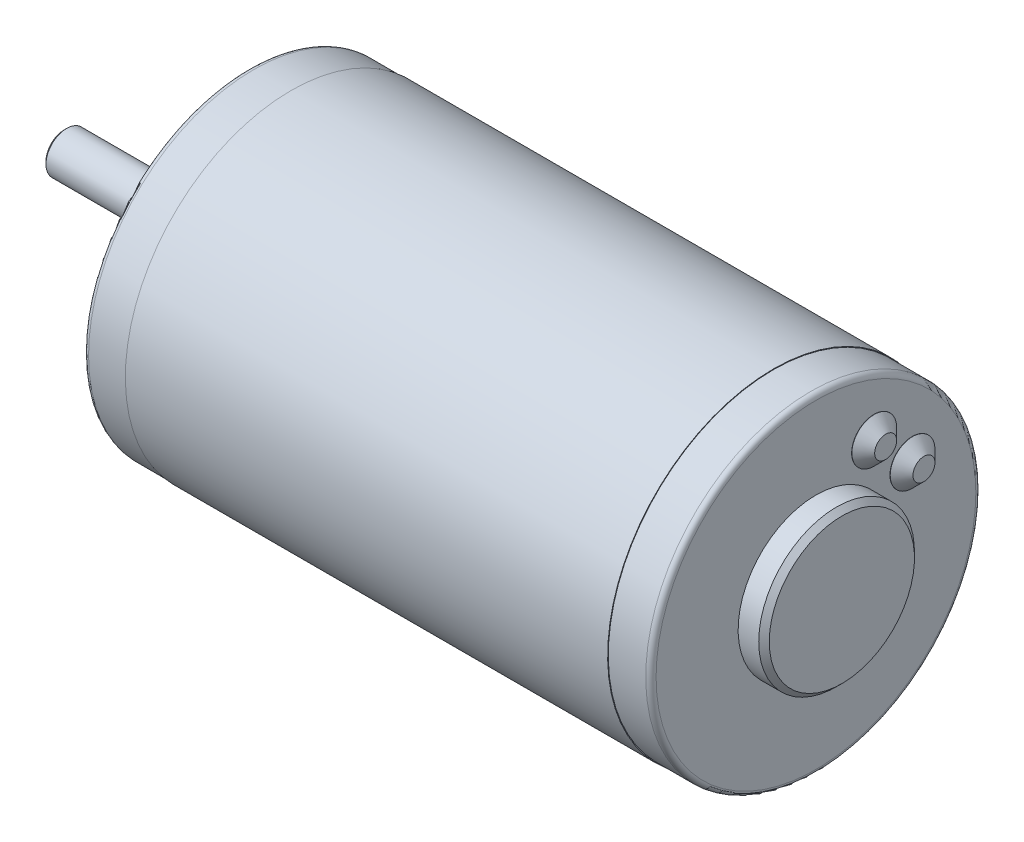
ISO-10303-21;
HEADER;
FILE_DESCRIPTION(('STEP AP214'),'2;1');
FILE_NAME('part.step','',(''),(''),'','','');
FILE_SCHEMA(('AUTOMOTIVE_DESIGN { 1 0 10303 214 1 1 1 1 }'));
ENDSEC;
DATA;
#1=APPLICATION_CONTEXT('core data for automotive mechanical design processes');
#2=APPLICATION_PROTOCOL_DEFINITION('international standard','automotive_design',2000,#1);
#3=PRODUCT_CONTEXT('',#1,'mechanical');
#4=PRODUCT('Part','Part','',(#3));
#5=PRODUCT_RELATED_PRODUCT_CATEGORY('part','',(#4));
#6=PRODUCT_DEFINITION_FORMATION('','',#4);
#7=PRODUCT_DEFINITION_CONTEXT('part definition',#1,'design');
#8=PRODUCT_DEFINITION('design','',#6,#7);
#9=PRODUCT_DEFINITION_SHAPE('','',#8);
#10=(LENGTH_UNIT() NAMED_UNIT(*) SI_UNIT(.MILLI.,.METRE.));
#11=(NAMED_UNIT(*) PLANE_ANGLE_UNIT() SI_UNIT($,.RADIAN.));
#12=(NAMED_UNIT(*) SI_UNIT($,.STERADIAN.) SOLID_ANGLE_UNIT());
#13=UNCERTAINTY_MEASURE_WITH_UNIT(LENGTH_MEASURE(1.E-05),#10,'distance_accuracy_value','');
#14=(GEOMETRIC_REPRESENTATION_CONTEXT(3) GLOBAL_UNCERTAINTY_ASSIGNED_CONTEXT((#13)) GLOBAL_UNIT_ASSIGNED_CONTEXT((#10,
#11,#12)) REPRESENTATION_CONTEXT('',''));
#15=CARTESIAN_POINT('',(0.,0.,0.));
#16=DIRECTION('',(0.,0.,1.));
#17=DIRECTION('',(1.,0.,0.));
#18=AXIS2_PLACEMENT_3D('',#15,#16,#17);
#19=CARTESIAN_POINT('',(-35.6000000000001,1.73472347597681E-13,-2.77555756156289E-13));
#20=DIRECTION('',(-1.,0.,0.));
#21=DIRECTION('',(0.,0.,1.));
#22=AXIS2_PLACEMENT_3D('',#19,#20,#21);
#23=PLANE('',#22);
#24=CARTESIAN_POINT('',(-35.6000000000449,-1.04083408558612E-13,-2.35922392732846E-13));
#25=DIRECTION('',(1.,0.,0.));
#26=DIRECTION('',(0.,0.,-1.));
#27=AXIS2_PLACEMENT_3D('',#24,#25,#26);
#28=CIRCLE('',#27,3.50000000003069);
#29=CARTESIAN_POINT('',(-35.6000000000449,-1.04083408558612E-13,-3.50000000003092));
#30=VERTEX_POINT('',#29);
#31=EDGE_CURVE('E86',#30,#30,#28,.T.);
#32=ORIENTED_EDGE('',*,*,#31,.F.);
#33=EDGE_LOOP('',(#32));
#34=FACE_BOUND('',#33,.T.);
#35=ADVANCED_FACE('F17',(#34),#23,.T.);
#36=CARTESIAN_POINT('',(-27.6,-0.999999999999773,-2.79999999999991));
#37=DIRECTION('',(0.,0.,1.));
#38=DIRECTION('',(0.,-1.,0.));
#39=AXIS2_PLACEMENT_3D('',#36,#37,#38);
#40=PLANE('',#39);
#41=CARTESIAN_POINT('',(-7.09999999999983,0.,-2.80000000000004));
#42=DIRECTION('',(0.,0.,-1.));
#43=DIRECTION('',(0.,1.,0.));
#44=AXIS2_PLACEMENT_3D('',#41,#42,#43);
#45=CIRCLE('',#44,1.);
#46=CARTESIAN_POINT('',(-7.09999999999997,1.00000000000033,-2.8));
#47=VERTEX_POINT('',#46);
#48=CARTESIAN_POINT('',(-7.10000000000005,-0.999999999999912,-2.80000000000004));
#49=VERTEX_POINT('',#48);
#50=EDGE_CURVE('E354',#47,#49,#45,.T.);
#51=ORIENTED_EDGE('',*,*,#50,.T.);
#52=DIRECTION('',(1.,0.,0.));
#53=VECTOR('',#52,1.);
#54=CARTESIAN_POINT('',(-27.6,-0.999999999999773,-2.80000000000001));
#55=LINE('',#54,#53);
#56=CARTESIAN_POINT('',(-26.5999999999999,-0.999999999999773,-2.80000000000001));
#57=VERTEX_POINT('',#56);
#58=EDGE_CURVE('E75',#57,#49,#55,.T.);
#59=ORIENTED_EDGE('',*,*,#58,.F.);
#60=CARTESIAN_POINT('',(-26.6,-1.03988108337105E-13,-2.80000000000001));
#61=DIRECTION('',(0.,0.,1.));
#62=DIRECTION('',(0.,-1.,0.));
#63=AXIS2_PLACEMENT_3D('',#60,#61,#62);
#64=CIRCLE('',#63,1.);
#65=CARTESIAN_POINT('',(-26.5999999999999,1.00000000000012,-2.80000000000001));
#66=VERTEX_POINT('',#65);
#67=EDGE_CURVE('E77',#57,#66,#64,.F.);
#68=ORIENTED_EDGE('',*,*,#67,.T.);
#69=DIRECTION('',(1.,0.,0.));
#70=VECTOR('',#69,1.);
#71=CARTESIAN_POINT('',(-27.5999999999998,1.00000000000033,-2.79999999999996));
#72=LINE('',#71,#70);
#73=EDGE_CURVE('E80',#66,#47,#72,.T.);
#74=ORIENTED_EDGE('',*,*,#73,.T.);
#75=EDGE_LOOP('',(#51,#59,#68,#74));
#76=FACE_BOUND('',#75,.T.);
#77=ADVANCED_FACE('F79',(#76),#40,.F.);
#78=CARTESIAN_POINT('',(-27.5999999999998,1.00000000000033,-2.80000000000007));
#79=DIRECTION('',(0.,1.,0.));
#80=DIRECTION('',(0.,0.,1.));
#81=AXIS2_PLACEMENT_3D('',#78,#79,#80);
#82=PLANE('',#81);
#83=DIRECTION('',(0.,0.,1.));
#84=VECTOR('',#83,1.);
#85=CARTESIAN_POINT('',(-7.10000000000011,1.00000000000033,-2.80000000000007));
#86=LINE('',#85,#84);
#87=CARTESIAN_POINT('',(-7.09999999999997,1.00000000000045,-3.87298334620729));
#88=VERTEX_POINT('',#87);
#89=EDGE_CURVE('E94',#88,#47,#86,.T.);
#90=ORIENTED_EDGE('',*,*,#89,.T.);
#91=ORIENTED_EDGE('',*,*,#73,.F.);
#92=DIRECTION('',(0.,0.,1.));
#93=VECTOR('',#92,1.);
#94=CARTESIAN_POINT('',(-26.5999999999997,0.999999999999896,-3.87298334620738));
#95=LINE('',#94,#93);
#96=CARTESIAN_POINT('',(-26.5999999999999,1.00000000000006,-3.87298334620735));
#97=VERTEX_POINT('',#96);
#98=EDGE_CURVE('E85',#66,#97,#95,.F.);
#99=ORIENTED_EDGE('',*,*,#98,.T.);
#100=DIRECTION('',(1.,0.,0.));
#101=VECTOR('',#100,1.);
#102=CARTESIAN_POINT('',(0.,1.00000000000057,-3.87298334620726));
#103=LINE('',#102,#101);
#104=EDGE_CURVE('E109',#88,#97,#103,.F.);
#105=ORIENTED_EDGE('',*,*,#104,.F.);
#106=EDGE_LOOP('',(#90,#91,#99,#105));
#107=FACE_BOUND('',#106,.T.);
#108=ADVANCED_FACE('F90',(#107),#82,.F.);
#109=CARTESIAN_POINT('',(-35.1000000000568,-1.04083408558612E-13,-2.35922392732846E-13));
#110=DIRECTION('',(1.,0.,0.));
#111=DIRECTION('',(0.,0.,-1.));
#112=AXIS2_PLACEMENT_3D('',#109,#110,#111);
#113=CONICAL_SURFACE('',#112,4.00000000001886,0.785398163397448);
#114=ORIENTED_EDGE('',*,*,#31,.T.);
#115=EDGE_LOOP('',(#114));
#116=FACE_BOUND('',#115,.T.);
#117=CARTESIAN_POINT('',(-35.1000000000003,0.,0.));
#118=DIRECTION('',(1.,0.,0.));
#119=DIRECTION('',(0.,1.,0.));
#120=AXIS2_PLACEMENT_3D('',#117,#118,#119);
#121=CIRCLE('',#120,3.99999999999999);
#122=CARTESIAN_POINT('',(-35.1000000000003,3.99999999999999,0.));
#123=VERTEX_POINT('',#122);
#124=EDGE_CURVE('E107',#123,#123,#121,.T.);
#125=ORIENTED_EDGE('',*,*,#124,.F.);
#126=EDGE_LOOP('',(#125));
#127=FACE_BOUND('',#126,.T.);
#128=ADVANCED_FACE('F364',(#116,#127),#113,.T.);
#129=CARTESIAN_POINT('',(-26.6,-1.04517089427603E-13,-3.87298334620738));
#130=DIRECTION('',(0.,0.,1.));
#131=DIRECTION('',(0.,-1.,0.));
#132=AXIS2_PLACEMENT_3D('',#129,#130,#131);
#133=CYLINDRICAL_SURFACE('',#132,1.);
#134=CARTESIAN_POINT('',(-26.6,0.999999999999896,-3.87298334620744));
#135=CARTESIAN_POINT('',(-26.6276629618862,1.00000033683272,-3.87298148578631));
#136=CARTESIAN_POINT('',(-26.6553122166169,0.998851408973414,-3.87328009898516));
#137=CARTESIAN_POINT('',(-26.7104039432582,0.994271305308465,-3.874459045294));
#138=CARTESIAN_POINT('',(-26.7378464491771,0.99084051352083,-3.87533928052186));
#139=CARTESIAN_POINT('',(-26.8194530833432,0.977175260843312,-3.87881710393728));
#140=CARTESIAN_POINT('',(-26.8730564246123,0.963567703685188,-3.88225202757009));
#141=CARTESIAN_POINT('',(-26.977125593587,0.9277977666641,-3.89095430304384));
#142=CARTESIAN_POINT('',(-27.0275916629556,0.905636046675176,-3.89622151353782));
#143=CARTESIAN_POINT('',(-27.1241130864299,0.853414285078966,-3.90799157486741));
#144=CARTESIAN_POINT('',(-27.1701674100592,0.823352404294419,-3.91449471333244));
#145=CARTESIAN_POINT('',(-27.2575394864379,0.755487979247824,-3.92816193945041));
#146=CARTESIAN_POINT('',(-27.2987466452782,0.71754520146856,-3.93533648748832));
#147=CARTESIAN_POINT('',(-27.374295287631,0.635284227526676,-3.94944965646413));
#148=CARTESIAN_POINT('',(-27.4086343067441,0.590963752716439,-3.95638819197843));
#149=CARTESIAN_POINT('',(-27.4699263913366,0.496434353262319,-3.96936513280701));
#150=CARTESIAN_POINT('',(-27.4967663594361,0.446150035120147,-3.97538918749289));
#151=CARTESIAN_POINT('',(-27.5415435234846,0.34164231638429,-3.98572777190496));
#152=CARTESIAN_POINT('',(-27.5594913901323,0.287423727052179,-3.99004434937703));
#153=CARTESIAN_POINT('',(-27.5817561327114,0.194111735626768,-3.99546891720265));
#154=CARTESIAN_POINT('',(-27.5885857933547,0.15563291802012,-3.99715927898668));
#155=CARTESIAN_POINT('',(-27.5977085408135,0.0781080027780594,-3.99942531582645));
#156=CARTESIAN_POINT('',(-27.6000016937716,0.0390619134218824,-4.00000100713419));
#157=CARTESIAN_POINT('',(-27.599997605085,-0.0552317459833981,-3.99999857595864));
#158=CARTESIAN_POINT('',(-27.5954072017814,-0.110495128478842,-3.99884417849431));
#159=CARTESIAN_POINT('',(-27.5771887284744,-0.219452299234425,-3.99434884496973));
#160=CARTESIAN_POINT('',(-27.5635520456883,-0.273144540728266,-3.99100582520555));
#161=CARTESIAN_POINT('',(-27.5277065776785,-0.377348216031208,-3.98250401525138));
#162=CARTESIAN_POINT('',(-27.50550949133,-0.427863881926167,-3.97734770399772));
#163=CARTESIAN_POINT('',(-27.4532106110737,-0.524450982676889,-3.96576858613918));
#164=CARTESIAN_POINT('',(-27.423109018223,-0.570522530531439,-3.95934581174879));
#165=CARTESIAN_POINT('',(-27.3552003629654,-0.657866871057299,-3.9457829173005));
#166=CARTESIAN_POINT('',(-27.3172610821917,-0.699035148909396,-3.93863172676561));
#167=CARTESIAN_POINT('',(-27.2350335448417,-0.774497762760093,-3.92449111086286));
#168=CARTESIAN_POINT('',(-27.1907442793301,-0.808791004318464,-3.91750171140699));
#169=CARTESIAN_POINT('',(-27.0962571540368,-0.870026617564701,-3.90436326544459));
#170=CARTESIAN_POINT('',(-27.0459800204074,-0.896849892050615,-3.8982285370107));
#171=CARTESIAN_POINT('',(-26.9414633719416,-0.941609493202719,-3.88766043493566));
#172=CARTESIAN_POINT('',(-26.8872268673447,-0.959552492279237,-3.88322578446615));
#173=CARTESIAN_POINT('',(-26.7939162001484,-0.981793057388644,-3.87765011739133));
#174=CARTESIAN_POINT('',(-26.7554596460299,-0.988610024877078,-3.87591131774121));
#175=CARTESIAN_POINT('',(-26.6780089785749,-0.997716332082892,-3.87357302813834));
#176=CARTESIAN_POINT('',(-26.6390152728011,-1.0000089326104,-3.87297271766373));
#177=CARTESIAN_POINT('',(-26.5999999999999,-1.00000000000011,-3.87298334620738));
#178=B_SPLINE_CURVE_WITH_KNOTS('',3,(#134,#135,#136,#137,#138,#139,#140,#141,#142,#143,#144,
#145,#146,#147,#148,#149,#150,#151,#152,#153,#154,#155,#156,#157,#158,#159,#160,#161,#162,#163,
#164,#165,#166,#167,#168,#169,#170,#171,#172,#173,#174,#175,#176,#177),.UNSPECIFIED.,.F.,.F.,(4,
2,2,2,2,2,2,2,2,2,2,2,2,2,2,2,2,2,2,2,2,4),(0.,0.0829364608197416,0.165858967679138,
0.331229962709977,0.496588203456516,0.66198497417125,0.830625162094533,0.999325752711568,
1.17044795789403,1.34136431261154,1.45844938979963,1.57553275986401,1.74108325106581,
1.9067915862413,2.07227425793979,2.23775272086773,2.4062917684524,2.57485762457931,
2.74597444954031,2.91696250578406,3.03398040676348,3.15091393953954),.UNSPECIFIED.);
#179=CARTESIAN_POINT('',(-26.5999999999999,-0.999999999999796,-3.87298334620746));
#180=VERTEX_POINT('',#179);
#181=EDGE_CURVE('E99',#97,#180,#178,.T.);
#182=ORIENTED_EDGE('',*,*,#181,.F.);
#183=ORIENTED_EDGE('',*,*,#98,.F.);
#184=ORIENTED_EDGE('',*,*,#67,.F.);
#185=DIRECTION('',(0.,0.,1.));
#186=VECTOR('',#185,1.);
#187=CARTESIAN_POINT('',(-26.5999999999998,-0.999999999999773,-2.79999999999991));
#188=LINE('',#187,#186);
#189=EDGE_CURVE('E101',#180,#57,#188,.T.);
#190=ORIENTED_EDGE('',*,*,#189,.F.);
#191=EDGE_LOOP('',(#182,#183,#184,#190));
#192=FACE_BOUND('',#191,.T.);
#193=ADVANCED_FACE('F97',(#192),#133,.F.);
#194=CARTESIAN_POINT('',(-27.6,-0.999999999999773,-2.79999999999991));
#195=DIRECTION('',(0.,1.,0.));
#196=DIRECTION('',(0.,0.,1.));
#197=AXIS2_PLACEMENT_3D('',#194,#195,#196);
#198=PLANE('',#197);
#199=DIRECTION('',(1.,0.,0.));
#200=VECTOR('',#199,1.);
#201=CARTESIAN_POINT('',(0.,-0.999999999999817,-3.87298334620746));
#202=LINE('',#201,#200);
#203=CARTESIAN_POINT('',(-7.10000000000022,-0.999999999999993,-3.87298334620743));
#204=VERTEX_POINT('',#203);
#205=EDGE_CURVE('E164',#180,#204,#202,.T.);
#206=ORIENTED_EDGE('',*,*,#205,.F.);
#207=ORIENTED_EDGE('',*,*,#189,.T.);
#208=ORIENTED_EDGE('',*,*,#58,.T.);
#209=DIRECTION('',(0.,0.,-1.));
#210=VECTOR('',#209,1.);
#211=CARTESIAN_POINT('',(-7.10000000000027,-1.00000000000005,-2.8));
#212=LINE('',#211,#210);
#213=EDGE_CURVE('E105',#49,#204,#212,.T.);
#214=ORIENTED_EDGE('',*,*,#213,.T.);
#215=EDGE_LOOP('',(#206,#207,#208,#214));
#216=FACE_BOUND('',#215,.T.);
#217=ADVANCED_FACE('F552',(#216),#198,.T.);
#218=CARTESIAN_POINT('',(-7.09999999999983,0.,-2.8));
#219=DIRECTION('',(0.,0.,-1.));
#220=DIRECTION('',(0.,1.,0.));
#221=AXIS2_PLACEMENT_3D('',#218,#219,#220);
#222=CYLINDRICAL_SURFACE('',#221,1.);
#223=ORIENTED_EDGE('',*,*,#50,.F.);
#224=ORIENTED_EDGE('',*,*,#89,.F.);
#225=CARTESIAN_POINT('',(-7.10000000000016,-1.00000000000005,-3.8729833462074));
#226=CARTESIAN_POINT('',(-7.072337038114,-1.00000033683288,-3.87298148578626));
#227=CARTESIAN_POINT('',(-7.04468778338332,-0.998851408973587,-3.87328009898511));
#228=CARTESIAN_POINT('',(-6.98959605674198,-0.994271305308656,-3.87445904529395));
#229=CARTESIAN_POINT('',(-6.96215355082305,-0.99084051352103,-3.87533928052181));
#230=CARTESIAN_POINT('',(-6.88054691665694,-0.977175260843541,-3.87881710393723));
#231=CARTESIAN_POINT('',(-6.8269435753879,-0.963567703685435,-3.88225202757002));
#232=CARTESIAN_POINT('',(-6.72287440641311,-0.927797766664384,-3.89095430304377));
#233=CARTESIAN_POINT('',(-6.6724083370446,-0.905636046675479,-3.89622151353775));
#234=CARTESIAN_POINT('',(-6.57588691357024,-0.853414285079304,-3.90799157486733));
#235=CARTESIAN_POINT('',(-6.52983258994098,-0.823352404294773,-3.91449471333236));
#236=CARTESIAN_POINT('',(-6.44246051356226,-0.75548797924821,-3.92816193945033));
#237=CARTESIAN_POINT('',(-6.40125335472195,-0.717545201468963,-3.93533648748825));
#238=CARTESIAN_POINT('',(-6.32570471236904,-0.635284227527108,-3.94944965646406));
#239=CARTESIAN_POINT('',(-6.29136569325591,-0.590963752716884,-3.95638819197836));
#240=CARTESIAN_POINT('',(-6.23007360866342,-0.496434353262786,-3.96936513280695));
#241=CARTESIAN_POINT('',(-6.20323364056388,-0.446150035120625,-3.97538918749283));
#242=CARTESIAN_POINT('',(-6.15845647651535,-0.341642316384785,-3.98572777190491));
#243=CARTESIAN_POINT('',(-6.14050860986763,-0.28742372705268,-3.990044349377));
#244=CARTESIAN_POINT('',(-6.11824386728853,-0.194111735627195,-3.99546891720263));
#245=CARTESIAN_POINT('',(-6.11141420664517,-0.155632918020465,-3.99715927898667));
#246=CARTESIAN_POINT('',(-6.10229145918636,-0.0781080027782378,-3.99942531582645));
#247=CARTESIAN_POINT('',(-6.09999830622821,-0.0390619134219762,-4.00000100713419));
#248=CARTESIAN_POINT('',(-6.10000239491486,0.0552317459833889,-3.99999857595864));
#249=CARTESIAN_POINT('',(-6.10459279821841,0.110495128478832,-3.99884417849431));
#250=CARTESIAN_POINT('',(-6.12281127152547,0.219452299234413,-3.99434884496973));
#251=CARTESIAN_POINT('',(-6.13644795431156,0.273144540728252,-3.99100582520555));
#252=CARTESIAN_POINT('',(-6.17229342232141,0.37734821603119,-3.98250401525138));
#253=CARTESIAN_POINT('',(-6.19449050866989,0.427863881926146,-3.97734770399773));
#254=CARTESIAN_POINT('',(-6.24678938892622,0.524450982676861,-3.96576858613919));
#255=CARTESIAN_POINT('',(-6.2768909817769,0.570522530531407,-3.95934581174879));
#256=CARTESIAN_POINT('',(-6.3447996370345,0.657866871057259,-3.94578291730051));
#257=CARTESIAN_POINT('',(-6.38273891780822,0.699035148909351,-3.93863172676562));
#258=CARTESIAN_POINT('',(-6.46496645515824,0.774497762760036,-3.92449111086287));
#259=CARTESIAN_POINT('',(-6.50925572066989,0.808791004318401,-3.917501711407));
#260=CARTESIAN_POINT('',(-6.60374284596318,0.870026617564623,-3.90436326544461));
#261=CARTESIAN_POINT('',(-6.65401997959254,0.89684989205053,-3.89822853701072));
#262=CARTESIAN_POINT('',(-6.75853662805843,0.941609493202617,-3.88766043493568));
#263=CARTESIAN_POINT('',(-6.81277313265532,0.959552492279126,-3.88322578446618));
#264=CARTESIAN_POINT('',(-6.90608379985158,0.98179305738851,-3.87765011739136));
#265=CARTESIAN_POINT('',(-6.94454035396997,0.988610024876933,-3.87591131774125));
#266=CARTESIAN_POINT('',(-7.02199102142495,0.997716332082737,-3.87357302813837));
#267=CARTESIAN_POINT('',(-7.06098472719867,1.00000893261024,-3.87297271766377));
#268=CARTESIAN_POINT('',(-7.09999999999986,0.999999999999951,-3.87298334620742));
#269=B_SPLINE_CURVE_WITH_KNOTS('',3,(#225,#226,#227,#228,#229,#230,#231,#232,#233,#234,#235,
#236,#237,#238,#239,#240,#241,#242,#243,#244,#245,#246,#247,#248,#249,#250,#251,#252,#253,#254,
#255,#256,#257,#258,#259,#260,#261,#262,#263,#264,#265,#266,#267,#268),.UNSPECIFIED.,.F.,.F.,(4,
2,2,2,2,2,2,2,2,2,2,2,2,2,2,2,2,2,2,2,2,4),(0.,0.0829364608197386,0.165858967679133,
0.331229962709968,0.496588203456498,0.661984974171228,0.830625162094508,0.99932575271154,
1.170447957894,1.34136431261151,1.45844938979986,1.57553275986449,1.74108325106629,
1.90679158624178,2.07227425794027,2.23775272086822,2.40629176845289,2.5748576245798,
2.7459744495408,2.91696250578455,3.03398040676384,3.15091393953981),.UNSPECIFIED.);
#270=EDGE_CURVE('E156',#204,#88,#269,.T.);
#271=ORIENTED_EDGE('',*,*,#270,.F.);
#272=ORIENTED_EDGE('',*,*,#213,.F.);
#273=EDGE_LOOP('',(#223,#224,#271,#272));
#274=FACE_BOUND('',#273,.T.);
#275=ADVANCED_FACE('F171',(#274),#222,.F.);
#276=CARTESIAN_POINT('',(0.,0.,0.));
#277=DIRECTION('',(1.,0.,0.));
#278=DIRECTION('',(0.,1.,0.));
#279=AXIS2_PLACEMENT_3D('',#276,#277,#278);
#280=CYLINDRICAL_SURFACE('',#279,3.99999999999999);
#281=ORIENTED_EDGE('',*,*,#124,.T.);
#282=EDGE_LOOP('',(#281));
#283=FACE_BOUND('',#282,.T.);
#284=ORIENTED_EDGE('',*,*,#104,.T.);
#285=ORIENTED_EDGE('',*,*,#181,.T.);
#286=ORIENTED_EDGE('',*,*,#205,.T.);
#287=ORIENTED_EDGE('',*,*,#270,.T.);
#288=EDGE_LOOP('',(#284,#285,#286,#287));
#289=FACE_BOUND('',#288,.T.);
#290=CARTESIAN_POINT('',(-4.00000000000022,0.,0.));
#291=DIRECTION('',(1.,0.,0.));
#292=DIRECTION('',(0.,1.,0.));
#293=AXIS2_PLACEMENT_3D('',#290,#291,#292);
#294=CIRCLE('',#293,3.99999999999999);
#295=CARTESIAN_POINT('',(-4.00000000000022,3.99999999999999,0.));
#296=VERTEX_POINT('',#295);
#297=EDGE_CURVE('E153',#296,#296,#294,.T.);
#298=ORIENTED_EDGE('',*,*,#297,.F.);
#299=EDGE_LOOP('',(#298));
#300=FACE_BOUND('',#299,.T.);
#301=ADVANCED_FACE('F174',(#283,#289,#300),#280,.T.);
#302=CARTESIAN_POINT('',(-4.00000000000011,4.00000000000001,-1.2490009027033E-13));
#303=DIRECTION('',(-1.,0.,0.));
#304=DIRECTION('',(0.,0.,1.));
#305=AXIS2_PLACEMENT_3D('',#302,#303,#304);
#306=PLANE('',#305);
#307=ORIENTED_EDGE('',*,*,#297,.T.);
#308=EDGE_LOOP('',(#307));
#309=FACE_BOUND('',#308,.T.);
#310=CARTESIAN_POINT('',(-4.00000000000009,1.66487194401081E-13,0.));
#311=DIRECTION('',(1.,0.,0.));
#312=DIRECTION('',(0.,1.,0.));
#313=AXIS2_PLACEMENT_3D('',#310,#311,#312);
#314=CIRCLE('',#313,8.50899999999978);
#315=CARTESIAN_POINT('',(-4.00000000000009,8.50899999999995,0.));
#316=VERTEX_POINT('',#315);
#317=EDGE_CURVE('E150',#316,#316,#314,.T.);
#318=ORIENTED_EDGE('',*,*,#317,.F.);
#319=EDGE_LOOP('',(#318));
#320=FACE_BOUND('',#319,.T.);
#321=ADVANCED_FACE('F178',(#309,#320),#306,.T.);
#322=CARTESIAN_POINT('',(111.8479,18.6070906828551,-11.2073596390946));
#323=DIRECTION('',(1.,0.,0.));
#324=DIRECTION('',(0.,0.,-1.));
#325=AXIS2_PLACEMENT_3D('',#322,#323,#324);
#326=PLANE('',#325);
#327=CARTESIAN_POINT('',(111.84789999993,18.6070906828551,-11.2073596390946));
#328=DIRECTION('',(-1.,0.,0.));
#329=DIRECTION('',(0.,-1.,0.));
#330=AXIS2_PLACEMENT_3D('',#327,#328,#329);
#331=CIRCLE('',#330,2.11800000003175);
#332=CARTESIAN_POINT('',(111.84789999993,16.4890906828234,-11.2073596390946));
#333=VERTEX_POINT('',#332);
#334=EDGE_CURVE('E147',#333,#333,#331,.T.);
#335=ORIENTED_EDGE('',*,*,#334,.F.);
#336=EDGE_LOOP('',(#335));
#337=FACE_BOUND('',#336,.T.);
#338=ADVANCED_FACE('F183',(#337),#326,.T.);
#339=CARTESIAN_POINT('',(114.6,15.0368000000001,-2.63677968348475E-13));
#340=DIRECTION('',(1.,0.,0.));
#341=DIRECTION('',(0.,0.,-1.));
#342=AXIS2_PLACEMENT_3D('',#339,#340,#341);
#343=PLANE('',#342);
#344=CARTESIAN_POINT('',(114.6,2.91377144650731E-13,0.));
#345=DIRECTION('',(-1.,0.,0.));
#346=DIRECTION('',(0.,0.,1.));
#347=AXIS2_PLACEMENT_3D('',#344,#345,#346);
#348=CIRCLE('',#347,14.0208);
#349=CARTESIAN_POINT('',(114.6,2.91377144650731E-13,14.0207999999999));
#350=VERTEX_POINT('',#349);
#351=EDGE_CURVE('E144',#350,#350,#348,.T.);
#352=ORIENTED_EDGE('',*,*,#351,.F.);
#353=EDGE_LOOP('',(#352));
#354=FACE_BOUND('',#353,.T.);
#355=ADVANCED_FACE('F187',(#354),#343,.T.);
#356=CARTESIAN_POINT('',(111.8479,11.2073596390942,-18.6070906828554));
#357=DIRECTION('',(1.,0.,0.));
#358=DIRECTION('',(0.,0.,-1.));
#359=AXIS2_PLACEMENT_3D('',#356,#357,#358);
#360=PLANE('',#359);
#361=CARTESIAN_POINT('',(111.84789999993,11.2073596390942,-18.6070906828554));
#362=DIRECTION('',(-1.,0.,0.));
#363=DIRECTION('',(0.,0.,1.));
#364=AXIS2_PLACEMENT_3D('',#361,#362,#363);
#365=CIRCLE('',#364,2.11800000000219);
#366=CARTESIAN_POINT('',(111.84789999993,11.2073596390942,-16.4890906828532));
#367=VERTEX_POINT('',#366);
#368=EDGE_CURVE('E140',#367,#367,#365,.T.);
#369=ORIENTED_EDGE('',*,*,#368,.F.);
#370=EDGE_LOOP('',(#369));
#371=FACE_BOUND('',#370,.T.);
#372=ADVANCED_FACE('F191',(#371),#360,.T.);
#373=CARTESIAN_POINT('',(13.6144000000513,25.4000000000002,-3.60822483003176E-13));
#374=DIRECTION('',(-1.,0.,0.));
#375=DIRECTION('',(0.,-1.,0.));
#376=AXIS2_PLACEMENT_3D('',#373,#374,#375);
#377=CONICAL_SURFACE('',#376,2.01929999985886,1.02974425857689);
#378=CARTESIAN_POINT('',(14.8277178480214,25.4000000000002,5.64825974301894E-11));
#379=VERTEX_POINT('',#378);
#380=VERTEX_LOOP('',#379);
#381=FACE_BOUND('',#380,.T.);
#382=CARTESIAN_POINT('',(13.6144000000001,25.4,-2.08155008518183E-13));
#383=DIRECTION('',(-1.,0.,0.));
#384=DIRECTION('',(0.,-1.,0.));
#385=AXIS2_PLACEMENT_3D('',#382,#383,#384);
#386=CIRCLE('',#385,2.0193);
#387=CARTESIAN_POINT('',(13.6144000000001,23.3807,-2.08155008518183E-13));
#388=VERTEX_POINT('',#387);
#389=EDGE_CURVE('E143',#388,#388,#386,.T.);
#390=ORIENTED_EDGE('',*,*,#389,.T.);
#391=EDGE_LOOP('',(#390));
#392=FACE_BOUND('',#391,.T.);
#393=ADVANCED_FACE('F195',(#381,#392),#377,.F.);
#394=CARTESIAN_POINT('',(13.6144000000513,-25.3999999999997,0.));
#395=DIRECTION('',(-1.,0.,0.));
#396=DIRECTION('',(0.,-1.,0.));
#397=AXIS2_PLACEMENT_3D('',#394,#395,#396);
#398=CONICAL_SURFACE('',#397,2.01929999985854,1.02974425857674);
#399=CARTESIAN_POINT('',(14.8277178480214,-25.3999999999997,5.6808725443673E-11));
#400=VERTEX_POINT('',#399);
#401=VERTEX_LOOP('',#400);
#402=FACE_BOUND('',#401,.T.);
#403=CARTESIAN_POINT('',(13.6143999999999,-25.3999999999997,0.));
#404=DIRECTION('',(-1.,0.,0.));
#405=DIRECTION('',(0.,-1.,0.));
#406=AXIS2_PLACEMENT_3D('',#403,#404,#405);
#407=CIRCLE('',#406,2.0193);
#408=CARTESIAN_POINT('',(13.6143999999999,-27.4192999999997,0.));
#409=VERTEX_POINT('',#408);
#410=EDGE_CURVE('E344',#409,#409,#407,.T.);
#411=ORIENTED_EDGE('',*,*,#410,.T.);
#412=EDGE_LOOP('',(#411));
#413=FACE_BOUND('',#412,.T.);
#414=ADVANCED_FACE('F199',(#402,#413),#398,.F.);
#415=CARTESIAN_POINT('',(-2.98399999999987,1.66533453693773E-13,0.));
#416=DIRECTION('',(1.,0.,0.));
#417=DIRECTION('',(0.,1.,0.));
#418=AXIS2_PLACEMENT_3D('',#415,#416,#417);
#419=CONICAL_SURFACE('',#418,9.525,0.78539816339745);
#420=ORIENTED_EDGE('',*,*,#317,.T.);
#421=EDGE_LOOP('',(#420));
#422=FACE_BOUND('',#421,.T.);
#423=CARTESIAN_POINT('',(-2.98399999999988,0.,0.));
#424=DIRECTION('',(1.,0.,0.));
#425=DIRECTION('',(0.,1.,0.));
#426=AXIS2_PLACEMENT_3D('',#423,#424,#425);
#427=CIRCLE('',#426,9.525);
#428=CARTESIAN_POINT('',(-2.98399999999988,9.525,0.));
#429=VERTEX_POINT('',#428);
#430=EDGE_CURVE('E339',#429,#429,#427,.T.);
#431=ORIENTED_EDGE('',*,*,#430,.F.);
#432=EDGE_LOOP('',(#431));
#433=FACE_BOUND('',#432,.T.);
#434=ADVANCED_FACE('F203',(#422,#433),#419,.T.);
#435=CARTESIAN_POINT('',(109.647900000027,18.6070906828551,-11.2073596390946));
#436=DIRECTION('',(-1.,0.,0.));
#437=DIRECTION('',(0.,-1.,0.));
#438=AXIS2_PLACEMENT_3D('',#435,#436,#437);
#439=CONICAL_SURFACE('',#438,4.31799999987741,0.785398163384529);
#440=CARTESIAN_POINT('',(109.6479,18.6070906828551,-11.2073596390946));
#441=DIRECTION('',(-1.,0.,0.));
#442=DIRECTION('',(0.,-1.,0.));
#443=AXIS2_PLACEMENT_3D('',#440,#441,#442);
#444=CIRCLE('',#443,4.318);
#445=CARTESIAN_POINT('',(109.6479,14.2890906828551,-11.2073596390946));
#446=VERTEX_POINT('',#445);
#447=EDGE_CURVE('E337',#446,#446,#444,.T.);
#448=ORIENTED_EDGE('',*,*,#447,.F.);
#449=EDGE_LOOP('',(#448));
#450=FACE_BOUND('',#449,.T.);
#451=ORIENTED_EDGE('',*,*,#334,.T.);
#452=EDGE_LOOP('',(#451));
#453=FACE_BOUND('',#452,.T.);
#454=ADVANCED_FACE('F207',(#450,#453),#439,.T.);
#455=CARTESIAN_POINT('',(113.584,2.91377144650731E-13,0.));
#456=DIRECTION('',(-1.,0.,0.));
#457=DIRECTION('',(0.,0.,1.));
#458=AXIS2_PLACEMENT_3D('',#455,#456,#457);
#459=CONICAL_SURFACE('',#458,15.0368000000001,0.78539816339744);
#460=ORIENTED_EDGE('',*,*,#351,.T.);
#461=EDGE_LOOP('',(#460));
#462=FACE_BOUND('',#461,.T.);
#463=CARTESIAN_POINT('',(113.584,0.,0.));
#464=DIRECTION('',(1.,0.,0.));
#465=DIRECTION('',(0.,1.,0.));
#466=AXIS2_PLACEMENT_3D('',#463,#464,#465);
#467=CIRCLE('',#466,15.0368);
#468=CARTESIAN_POINT('',(113.584,15.0368,0.));
#469=VERTEX_POINT('',#468);
#470=EDGE_CURVE('E338',#469,#469,#467,.F.);
#471=ORIENTED_EDGE('',*,*,#470,.F.);
#472=EDGE_LOOP('',(#471));
#473=FACE_BOUND('',#472,.T.);
#474=ADVANCED_FACE('F211',(#462,#473),#459,.T.);
#475=CARTESIAN_POINT('',(109.647900000084,11.2073596390942,-18.6070906828554));
#476=DIRECTION('',(-1.,0.,0.));
#477=DIRECTION('',(0.,0.,1.));
#478=AXIS2_PLACEMENT_3D('',#475,#476,#477);
#479=CONICAL_SURFACE('',#478,4.3179999999047,0.785398163410367);
#480=CARTESIAN_POINT('',(109.6479,11.2073596390942,-18.6070906828554));
#481=DIRECTION('',(-1.,0.,0.));
#482=DIRECTION('',(0.,-1.,0.));
#483=AXIS2_PLACEMENT_3D('',#480,#481,#482);
#484=CIRCLE('',#483,4.318);
#485=CARTESIAN_POINT('',(109.6479,6.88935963909421,-18.6070906828554));
#486=VERTEX_POINT('',#485);
#487=EDGE_CURVE('E139',#486,#486,#484,.T.);
#488=ORIENTED_EDGE('',*,*,#487,.F.);
#489=EDGE_LOOP('',(#488));
#490=FACE_BOUND('',#489,.T.);
#491=ORIENTED_EDGE('',*,*,#368,.T.);
#492=EDGE_LOOP('',(#491));
#493=FACE_BOUND('',#492,.T.);
#494=ADVANCED_FACE('F215',(#490,#493),#479,.T.);
#495=CARTESIAN_POINT('',(-1.66099772824779E-13,25.4,-2.08166817117217E-13));
#496=DIRECTION('',(-1.,0.,0.));
#497=DIRECTION('',(0.,-1.,0.));
#498=AXIS2_PLACEMENT_3D('',#495,#496,#497);
#499=CYLINDRICAL_SURFACE('',#498,2.0193);
#500=CARTESIAN_POINT('',(-1.66434302367413E-13,25.4,-2.08166817117217E-13));
#501=DIRECTION('',(-1.,0.,0.));
#502=DIRECTION('',(0.,-1.,0.));
#503=AXIS2_PLACEMENT_3D('',#500,#501,#502);
#504=CIRCLE('',#503,2.0193);
#505=CARTESIAN_POINT('',(-1.66322208732085E-13,23.3807,-2.08166817117217E-13));
#506=VERTEX_POINT('',#505);
#507=EDGE_CURVE('E136',#506,#506,#504,.F.);
#508=ORIENTED_EDGE('',*,*,#507,.F.);
#509=EDGE_LOOP('',(#508));
#510=FACE_BOUND('',#509,.T.);
#511=ORIENTED_EDGE('',*,*,#389,.F.);
#512=EDGE_LOOP('',(#511));
#513=FACE_BOUND('',#512,.T.);
#514=ADVANCED_FACE('F219',(#510,#513),#499,.F.);
#515=CARTESIAN_POINT('',(1.66967134562768E-13,-25.3999999999997,0.));
#516=DIRECTION('',(-1.,0.,0.));
#517=DIRECTION('',(0.,-1.,0.));
#518=AXIS2_PLACEMENT_3D('',#515,#516,#517);
#519=CYLINDRICAL_SURFACE('',#518,2.0193);
#520=CARTESIAN_POINT('',(1.66632605020134E-13,-25.3999999999997,0.));
#521=DIRECTION('',(-1.,0.,0.));
#522=DIRECTION('',(0.,-1.,0.));
#523=AXIS2_PLACEMENT_3D('',#520,#521,#522);
#524=CIRCLE('',#523,2.0193);
#525=CARTESIAN_POINT('',(1.66744698655462E-13,-27.4192999999997,0.));
#526=VERTEX_POINT('',#525);
#527=EDGE_CURVE('E133',#526,#526,#524,.F.);
#528=ORIENTED_EDGE('',*,*,#527,.F.);
#529=EDGE_LOOP('',(#528));
#530=FACE_BOUND('',#529,.T.);
#531=ORIENTED_EDGE('',*,*,#410,.F.);
#532=EDGE_LOOP('',(#531));
#533=FACE_BOUND('',#532,.T.);
#534=ADVANCED_FACE('F223',(#530,#533),#519,.F.);
#535=CARTESIAN_POINT('',(0.,0.,0.));
#536=DIRECTION('',(1.,0.,0.));
#537=DIRECTION('',(0.,1.,0.));
#538=AXIS2_PLACEMENT_3D('',#535,#536,#537);
#539=CYLINDRICAL_SURFACE('',#538,9.525);
#540=ORIENTED_EDGE('',*,*,#430,.T.);
#541=EDGE_LOOP('',(#540));
#542=FACE_BOUND('',#541,.T.);
#543=CARTESIAN_POINT('',(0.,0.,0.));
#544=DIRECTION('',(1.,0.,0.));
#545=DIRECTION('',(0.,1.,0.));
#546=AXIS2_PLACEMENT_3D('',#543,#544,#545);
#547=CIRCLE('',#546,9.525);
#548=CARTESIAN_POINT('',(0.,9.525,0.));
#549=VERTEX_POINT('',#548);
#550=EDGE_CURVE('E130',#549,#549,#547,.T.);
#551=ORIENTED_EDGE('',*,*,#550,.F.);
#552=EDGE_LOOP('',(#551));
#553=FACE_BOUND('',#552,.T.);
#554=ADVANCED_FACE('F227',(#542,#553),#539,.T.);
#555=CARTESIAN_POINT('',(111.8479,18.6070906828551,-11.2073596390946));
#556=DIRECTION('',(-1.,0.,0.));
#557=DIRECTION('',(0.,-1.,0.));
#558=AXIS2_PLACEMENT_3D('',#555,#556,#557);
#559=CYLINDRICAL_SURFACE('',#558,4.318);
#560=CARTESIAN_POINT('',(109.6,18.6070906828551,-11.2073596390946));
#561=DIRECTION('',(-1.,0.,0.));
#562=DIRECTION('',(0.,-1.,0.));
#563=AXIS2_PLACEMENT_3D('',#560,#561,#562);
#564=CIRCLE('',#563,4.318);
#565=CARTESIAN_POINT('',(109.6,14.2890906828551,-11.2073596390946));
#566=VERTEX_POINT('',#565);
#567=EDGE_CURVE('E127',#566,#566,#564,.T.);
#568=ORIENTED_EDGE('',*,*,#567,.F.);
#569=EDGE_LOOP('',(#568));
#570=FACE_BOUND('',#569,.T.);
#571=ORIENTED_EDGE('',*,*,#447,.T.);
#572=EDGE_LOOP('',(#571));
#573=FACE_BOUND('',#572,.T.);
#574=ADVANCED_FACE('F231',(#570,#573),#559,.T.);
#575=CARTESIAN_POINT('',(0.,0.,0.));
#576=DIRECTION('',(1.,0.,0.));
#577=DIRECTION('',(0.,1.,0.));
#578=AXIS2_PLACEMENT_3D('',#575,#576,#577);
#579=CYLINDRICAL_SURFACE('',#578,15.0368);
#580=CARTESIAN_POINT('',(109.6,0.,0.));
#581=DIRECTION('',(1.,0.,0.));
#582=DIRECTION('',(0.,1.,0.));
#583=AXIS2_PLACEMENT_3D('',#580,#581,#582);
#584=CIRCLE('',#583,15.0368);
#585=CARTESIAN_POINT('',(109.6,15.0368,0.));
#586=VERTEX_POINT('',#585);
#587=EDGE_CURVE('E124',#586,#586,#584,.F.);
#588=ORIENTED_EDGE('',*,*,#587,.F.);
#589=EDGE_LOOP('',(#588));
#590=FACE_BOUND('',#589,.T.);
#591=ORIENTED_EDGE('',*,*,#470,.T.);
#592=EDGE_LOOP('',(#591));
#593=FACE_BOUND('',#592,.T.);
#594=ADVANCED_FACE('F235',(#590,#593),#579,.T.);
#595=CARTESIAN_POINT('',(111.8479,11.2073596390942,-18.6070906828554));
#596=DIRECTION('',(-1.,0.,0.));
#597=DIRECTION('',(0.,-1.,0.));
#598=AXIS2_PLACEMENT_3D('',#595,#596,#597);
#599=CYLINDRICAL_SURFACE('',#598,4.318);
#600=CARTESIAN_POINT('',(109.6,11.2073596390942,-18.6070906828554));
#601=DIRECTION('',(-1.,0.,0.));
#602=DIRECTION('',(0.,-1.,0.));
#603=AXIS2_PLACEMENT_3D('',#600,#601,#602);
#604=CIRCLE('',#603,4.318);
#605=CARTESIAN_POINT('',(109.6,6.88935963909421,-18.6070906828554));
#606=VERTEX_POINT('',#605);
#607=EDGE_CURVE('E120',#606,#606,#604,.T.);
#608=ORIENTED_EDGE('',*,*,#607,.F.);
#609=EDGE_LOOP('',(#608));
#610=FACE_BOUND('',#609,.T.);
#611=ORIENTED_EDGE('',*,*,#487,.T.);
#612=EDGE_LOOP('',(#611));
#613=FACE_BOUND('',#612,.T.);
#614=ADVANCED_FACE('F239',(#610,#613),#599,.T.);
#615=CARTESIAN_POINT('',(-3.88144377749811E-13,9.52499999999979,-1.94289029309402E-13));
#616=DIRECTION('',(-1.,0.,0.));
#617=DIRECTION('',(0.,0.,1.));
#618=AXIS2_PLACEMENT_3D('',#615,#616,#617);
#619=PLANE('',#618);
#620=ORIENTED_EDGE('',*,*,#550,.T.);
#621=EDGE_LOOP('',(#620));
#622=FACE_BOUND('',#621,.T.);
#623=CARTESIAN_POINT('',(-3.32199545649559E-13,0.,0.));
#624=DIRECTION('',(1.,0.,0.));
#625=DIRECTION('',(0.,0.,-1.));
#626=AXIS2_PLACEMENT_3D('',#623,#624,#625);
#627=CIRCLE('',#626,30.8769999999999);
#628=CARTESIAN_POINT('',(-3.5228773447155E-13,0.,-30.877));
#629=VERTEX_POINT('',#628);
#630=CARTESIAN_POINT('',(-3.56422802454019E-13,0.,30.8769999999999));
#631=VERTEX_POINT('',#630);
#632=EDGE_CURVE('E123',#629,#631,#627,.T.);
#633=ORIENTED_EDGE('',*,*,#632,.F.);
#634=CARTESIAN_POINT('',(-3.32199545649559E-13,0.,0.));
#635=DIRECTION('',(1.,0.,0.));
#636=DIRECTION('',(0.,0.,1.));
#637=AXIS2_PLACEMENT_3D('',#634,#635,#636);
#638=CIRCLE('',#637,30.877);
#639=EDGE_CURVE('E270',#631,#629,#638,.T.);
#640=ORIENTED_EDGE('',*,*,#639,.F.);
#641=EDGE_LOOP('',(#633,#640));
#642=FACE_BOUND('',#641,.T.);
#643=ORIENTED_EDGE('',*,*,#527,.T.);
#644=EDGE_LOOP('',(#643));
#645=FACE_BOUND('',#644,.T.);
#646=ORIENTED_EDGE('',*,*,#507,.T.);
#647=EDGE_LOOP('',(#646));
#648=FACE_BOUND('',#647,.T.);
#649=ADVANCED_FACE('F243',(#622,#642,#645,#648),#619,.T.);
#650=CARTESIAN_POINT('',(109.6,31.8769999999999,-2.08166817117217E-13));
#651=DIRECTION('',(1.,0.,0.));
#652=DIRECTION('',(0.,0.,-1.));
#653=AXIS2_PLACEMENT_3D('',#650,#651,#652);
#654=PLANE('',#653);
#655=ORIENTED_EDGE('',*,*,#607,.T.);
#656=EDGE_LOOP('',(#655));
#657=FACE_BOUND('',#656,.T.);
#658=ORIENTED_EDGE('',*,*,#587,.T.);
#659=EDGE_LOOP('',(#658));
#660=FACE_BOUND('',#659,.T.);
#661=CARTESIAN_POINT('',(109.6,-1.5260015475075E-13,0.));
#662=DIRECTION('',(-1.,0.,0.));
#663=DIRECTION('',(0.,0.,1.));
#664=AXIS2_PLACEMENT_3D('',#661,#662,#663);
#665=CIRCLE('',#664,30.8769999999999);
#666=CARTESIAN_POINT('',(109.6,0.,30.8769999999998));
#667=VERTEX_POINT('',#666);
#668=CARTESIAN_POINT('',(109.6,0.,-30.8770000000001));
#669=VERTEX_POINT('',#668);
#670=EDGE_CURVE('E36',#667,#669,#665,.T.);
#671=ORIENTED_EDGE('',*,*,#670,.F.);
#672=CARTESIAN_POINT('',(109.6,-1.5260015475075E-13,0.));
#673=DIRECTION('',(-1.,0.,0.));
#674=DIRECTION('',(0.,0.,-1.));
#675=AXIS2_PLACEMENT_3D('',#672,#673,#674);
#676=CIRCLE('',#675,30.8770000000001);
#677=EDGE_CURVE('E273',#669,#667,#676,.T.);
#678=ORIENTED_EDGE('',*,*,#677,.F.);
#679=EDGE_LOOP('',(#671,#678));
#680=FACE_BOUND('',#679,.T.);
#681=ORIENTED_EDGE('',*,*,#567,.T.);
#682=EDGE_LOOP('',(#681));
#683=FACE_BOUND('',#682,.T.);
#684=ADVANCED_FACE('F248',(#657,#660,#680,#683),#654,.T.);
#685=CARTESIAN_POINT('',(0.999999999999668,0.,0.));
#686=DIRECTION('',(-1.,0.,0.));
#687=DIRECTION('',(0.,0.,1.));
#688=AXIS2_PLACEMENT_3D('',#685,#686,#687);
#689=TOROIDAL_SURFACE('',#688,30.877,1.);
#690=CARTESIAN_POINT('',(0.999999999999668,0.,0.));
#691=DIRECTION('',(1.,0.,0.));
#692=DIRECTION('',(0.,1.,0.));
#693=AXIS2_PLACEMENT_3D('',#690,#691,#692);
#694=CIRCLE('',#693,31.877);
#695=CARTESIAN_POINT('',(0.999999999999666,31.877,0.));
#696=VERTEX_POINT('',#695);
#697=EDGE_CURVE('E300',#696,#696,#694,.T.);
#698=ORIENTED_EDGE('',*,*,#697,.F.);
#699=EDGE_LOOP('',(#698));
#700=FACE_BOUND('',#699,.T.);
#701=ORIENTED_EDGE('',*,*,#639,.T.);
#702=ORIENTED_EDGE('',*,*,#632,.T.);
#703=EDGE_LOOP('',(#701,#702));
#704=FACE_BOUND('',#703,.T.);
#705=ADVANCED_FACE('F274',(#700,#704),#689,.T.);
#706=CARTESIAN_POINT('',(108.6,-1.52655665885959E-13,0.));
#707=DIRECTION('',(1.,0.,0.));
#708=DIRECTION('',(0.,0.,-1.));
#709=AXIS2_PLACEMENT_3D('',#706,#707,#708);
#710=TOROIDAL_SURFACE('',#709,30.877,1.);
#711=CARTESIAN_POINT('',(108.6,0.,0.));
#712=DIRECTION('',(1.,0.,0.));
#713=DIRECTION('',(0.,1.,0.));
#714=AXIS2_PLACEMENT_3D('',#711,#712,#713);
#715=CIRCLE('',#714,31.877);
#716=CARTESIAN_POINT('',(108.6,31.877,0.));
#717=VERTEX_POINT('',#716);
#718=EDGE_CURVE('E119',#717,#717,#715,.F.);
#719=ORIENTED_EDGE('',*,*,#718,.F.);
#720=EDGE_LOOP('',(#719));
#721=FACE_BOUND('',#720,.T.);
#722=ORIENTED_EDGE('',*,*,#677,.T.);
#723=ORIENTED_EDGE('',*,*,#670,.T.);
#724=EDGE_LOOP('',(#722,#723));
#725=FACE_BOUND('',#724,.T.);
#726=ADVANCED_FACE('F280',(#721,#725),#710,.T.);
#727=CARTESIAN_POINT('',(0.,0.,0.));
#728=DIRECTION('',(1.,0.,0.));
#729=DIRECTION('',(0.,1.,0.));
#730=AXIS2_PLACEMENT_3D('',#727,#728,#729);
#731=CYLINDRICAL_SURFACE('',#730,31.877);
#732=ORIENTED_EDGE('',*,*,#697,.T.);
#733=EDGE_LOOP('',(#732));
#734=FACE_BOUND('',#733,.T.);
#735=CARTESIAN_POINT('',(8.22960000000013,0.,0.));
#736=DIRECTION('',(1.,0.,0.));
#737=DIRECTION('',(0.,1.,0.));
#738=AXIS2_PLACEMENT_3D('',#735,#736,#737);
#739=CIRCLE('',#738,31.877);
#740=CARTESIAN_POINT('',(8.22960000000012,31.877,0.));
#741=VERTEX_POINT('',#740);
#742=EDGE_CURVE('E116',#741,#741,#739,.T.);
#743=ORIENTED_EDGE('',*,*,#742,.F.);
#744=EDGE_LOOP('',(#743));
#745=FACE_BOUND('',#744,.T.);
#746=ADVANCED_FACE('F290',(#734,#745),#731,.T.);
#747=CARTESIAN_POINT('',(0.,0.,0.));
#748=DIRECTION('',(1.,0.,0.));
#749=DIRECTION('',(0.,1.,0.));
#750=AXIS2_PLACEMENT_3D('',#747,#748,#749);
#751=CYLINDRICAL_SURFACE('',#750,31.877);
#752=CARTESIAN_POINT('',(101.3704,0.,0.));
#753=DIRECTION('',(1.,0.,0.));
#754=DIRECTION('',(0.,1.,0.));
#755=AXIS2_PLACEMENT_3D('',#752,#753,#754);
#756=CIRCLE('',#755,31.877);
#757=CARTESIAN_POINT('',(101.3704,31.877,0.));
#758=VERTEX_POINT('',#757);
#759=EDGE_CURVE('E113',#758,#758,#756,.F.);
#760=ORIENTED_EDGE('',*,*,#759,.F.);
#761=EDGE_LOOP('',(#760));
#762=FACE_BOUND('',#761,.T.);
#763=ORIENTED_EDGE('',*,*,#718,.T.);
#764=EDGE_LOOP('',(#763));
#765=FACE_BOUND('',#764,.T.);
#766=ADVANCED_FACE('F386',(#762,#765),#751,.T.);
#767=CARTESIAN_POINT('',(8.22959999999978,31.8770000000001,0.));
#768=DIRECTION('',(-1.,0.,0.));
#769=DIRECTION('',(0.,0.,1.));
#770=AXIS2_PLACEMENT_3D('',#767,#768,#769);
#771=PLANE('',#770);
#772=CARTESIAN_POINT('',(8.22960000000012,0.,0.));
#773=DIRECTION('',(1.,0.,0.));
#774=DIRECTION('',(0.,1.,0.));
#775=AXIS2_PLACEMENT_3D('',#772,#773,#774);
#776=CIRCLE('',#775,32.004);
#777=CARTESIAN_POINT('',(8.22960000000012,32.004,0.));
#778=VERTEX_POINT('',#777);
#779=EDGE_CURVE('E28',#778,#778,#776,.T.);
#780=ORIENTED_EDGE('',*,*,#779,.F.);
#781=EDGE_LOOP('',(#780));
#782=FACE_BOUND('',#781,.T.);
#783=ORIENTED_EDGE('',*,*,#742,.T.);
#784=EDGE_LOOP('',(#783));
#785=FACE_BOUND('',#784,.T.);
#786=ADVANCED_FACE('F380',(#782,#785),#771,.T.);
#787=CARTESIAN_POINT('',(101.3704,32.0040000000003,-3.33066907387547E-13));
#788=DIRECTION('',(1.,0.,0.));
#789=DIRECTION('',(0.,0.,-1.));
#790=AXIS2_PLACEMENT_3D('',#787,#788,#789);
#791=PLANE('',#790);
#792=ORIENTED_EDGE('',*,*,#759,.T.);
#793=EDGE_LOOP('',(#792));
#794=FACE_BOUND('',#793,.T.);
#795=CARTESIAN_POINT('',(101.3704,0.,0.));
#796=DIRECTION('',(1.,0.,0.));
#797=DIRECTION('',(0.,1.,0.));
#798=AXIS2_PLACEMENT_3D('',#795,#796,#797);
#799=CIRCLE('',#798,32.004);
#800=CARTESIAN_POINT('',(101.3704,32.004,0.));
#801=VERTEX_POINT('',#800);
#802=EDGE_CURVE('E11',#801,#801,#799,.F.);
#803=ORIENTED_EDGE('',*,*,#802,.F.);
#804=EDGE_LOOP('',(#803));
#805=FACE_BOUND('',#804,.T.);
#806=ADVANCED_FACE('F374',(#794,#805),#791,.T.);
#807=CARTESIAN_POINT('',(0.,0.,0.));
#808=DIRECTION('',(1.,0.,0.));
#809=DIRECTION('',(0.,1.,0.));
#810=AXIS2_PLACEMENT_3D('',#807,#808,#809);
#811=CYLINDRICAL_SURFACE('',#810,32.004);
#812=ORIENTED_EDGE('',*,*,#779,.T.);
#813=EDGE_LOOP('',(#812));
#814=FACE_BOUND('',#813,.T.);
#815=ORIENTED_EDGE('',*,*,#802,.T.);
#816=EDGE_LOOP('',(#815));
#817=FACE_BOUND('',#816,.T.);
#818=ADVANCED_FACE('F372',(#814,#817),#811,.T.);
#819=CLOSED_SHELL('',(#35,#77,#108,#128,#193,#217,#275,#301,#321,#338,#355,#372,#393,#414,#434,
#454,#474,#494,#514,#534,#554,#574,#594,#614,#649,#684,#705,#726,#746,#766,#786,#806,#818));
#820=MANIFOLD_SOLID_BREP('B1',#819);
#821=ADVANCED_BREP_SHAPE_REPRESENTATION('',(#18,#820),#14);
#822=SHAPE_DEFINITION_REPRESENTATION(#9,#821);
ENDSEC;
END-ISO-10303-21;
